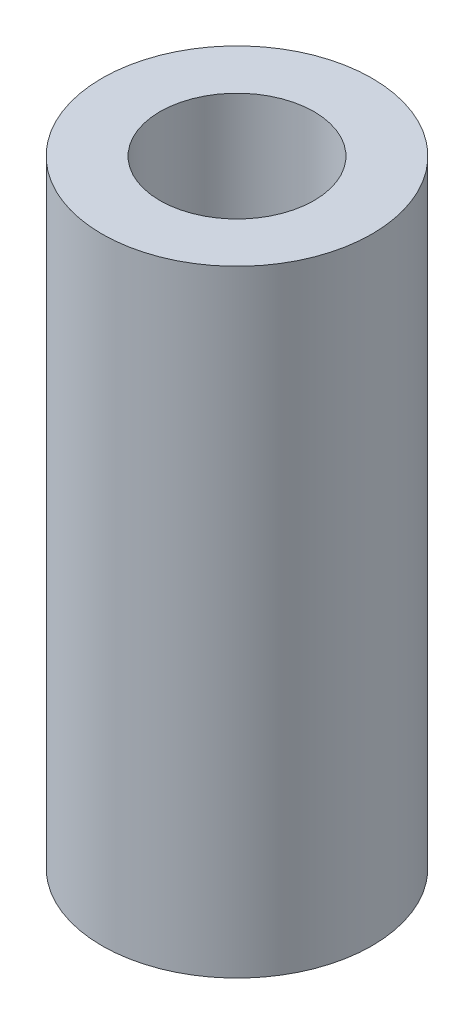
ISO-10303-21;
HEADER;
FILE_DESCRIPTION(('STEP AP214'),'2;1');
FILE_NAME('part.step','',(''),(''),'','','');
FILE_SCHEMA(('AUTOMOTIVE_DESIGN { 1 0 10303 214 1 1 1 1 }'));
ENDSEC;
DATA;
#1=APPLICATION_CONTEXT('core data for automotive mechanical design processes');
#2=APPLICATION_PROTOCOL_DEFINITION('international standard','automotive_design',2000,#1);
#3=PRODUCT_CONTEXT('',#1,'mechanical');
#4=PRODUCT('Part','Part','',(#3));
#5=PRODUCT_RELATED_PRODUCT_CATEGORY('part','',(#4));
#6=PRODUCT_DEFINITION_FORMATION('','',#4);
#7=PRODUCT_DEFINITION_CONTEXT('part definition',#1,'design');
#8=PRODUCT_DEFINITION('design','',#6,#7);
#9=PRODUCT_DEFINITION_SHAPE('','',#8);
#10=(LENGTH_UNIT() NAMED_UNIT(*) SI_UNIT(.MILLI.,.METRE.));
#11=(NAMED_UNIT(*) PLANE_ANGLE_UNIT() SI_UNIT($,.RADIAN.));
#12=(NAMED_UNIT(*) SI_UNIT($,.STERADIAN.) SOLID_ANGLE_UNIT());
#13=UNCERTAINTY_MEASURE_WITH_UNIT(LENGTH_MEASURE(1.E-05),#10,'distance_accuracy_value','');
#14=(GEOMETRIC_REPRESENTATION_CONTEXT(3) GLOBAL_UNCERTAINTY_ASSIGNED_CONTEXT((#13)) GLOBAL_UNIT_ASSIGNED_CONTEXT((#10,
#11,#12)) REPRESENTATION_CONTEXT('',''));
#15=CARTESIAN_POINT('',(0.,0.,0.));
#16=DIRECTION('',(0.,0.,1.));
#17=DIRECTION('',(1.,0.,0.));
#18=AXIS2_PLACEMENT_3D('',#15,#16,#17);
#19=CARTESIAN_POINT('',(0.,25.4,0.));
#20=DIRECTION('',(0.,1.,0.));
#21=DIRECTION('',(0.,0.,1.));
#22=AXIS2_PLACEMENT_3D('',#19,#20,#21);
#23=PLANE('',#22);
#24=CARTESIAN_POINT('',(0.,25.4,0.));
#25=DIRECTION('',(0.,1.,0.));
#26=DIRECTION('',(0.,0.,1.));
#27=AXIS2_PLACEMENT_3D('',#24,#25,#26);
#28=CIRCLE('',#27,5.5626);
#29=CARTESIAN_POINT('',(0.,25.4,5.5626));
#30=VERTEX_POINT('',#29);
#31=EDGE_CURVE('E10',#30,#30,#28,.T.);
#32=ORIENTED_EDGE('',*,*,#31,.T.);
#33=EDGE_LOOP('',(#32));
#34=FACE_BOUND('',#33,.T.);
#35=CARTESIAN_POINT('',(0.,25.4,0.));
#36=DIRECTION('',(0.,1.,0.));
#37=DIRECTION('',(0.,0.,1.));
#38=AXIS2_PLACEMENT_3D('',#35,#36,#37);
#39=CIRCLE('',#38,3.175);
#40=CARTESIAN_POINT('',(0.,25.4,3.175));
#41=VERTEX_POINT('',#40);
#42=EDGE_CURVE('E44',#41,#41,#39,.T.);
#43=ORIENTED_EDGE('',*,*,#42,.F.);
#44=EDGE_LOOP('',(#43));
#45=FACE_BOUND('',#44,.T.);
#46=ADVANCED_FACE('F33',(#34,#45),#23,.T.);
#47=CARTESIAN_POINT('',(0.,0.,0.));
#48=DIRECTION('',(0.,1.,0.));
#49=DIRECTION('',(0.,0.,1.));
#50=AXIS2_PLACEMENT_3D('',#47,#48,#49);
#51=PLANE('',#50);
#52=CARTESIAN_POINT('',(0.,0.,0.));
#53=DIRECTION('',(0.,1.,0.));
#54=DIRECTION('',(0.,0.,1.));
#55=AXIS2_PLACEMENT_3D('',#52,#53,#54);
#56=CIRCLE('',#55,5.5626);
#57=CARTESIAN_POINT('',(0.,0.,5.5626));
#58=VERTEX_POINT('',#57);
#59=EDGE_CURVE('E37',#58,#58,#56,.T.);
#60=ORIENTED_EDGE('',*,*,#59,.F.);
#61=EDGE_LOOP('',(#60));
#62=FACE_BOUND('',#61,.T.);
#63=CARTESIAN_POINT('',(0.,0.,0.));
#64=DIRECTION('',(0.,1.,0.));
#65=DIRECTION('',(0.,0.,1.));
#66=AXIS2_PLACEMENT_3D('',#63,#64,#65);
#67=CIRCLE('',#66,3.175);
#68=CARTESIAN_POINT('',(0.,0.,3.175));
#69=VERTEX_POINT('',#68);
#70=EDGE_CURVE('E46',#69,#69,#67,.T.);
#71=ORIENTED_EDGE('',*,*,#70,.T.);
#72=EDGE_LOOP('',(#71));
#73=FACE_BOUND('',#72,.T.);
#74=ADVANCED_FACE('F56',(#62,#73),#51,.F.);
#75=CARTESIAN_POINT('',(0.,25.4,0.));
#76=DIRECTION('',(0.,-1.,0.));
#77=DIRECTION('',(0.,0.,-1.));
#78=AXIS2_PLACEMENT_3D('',#75,#76,#77);
#79=CYLINDRICAL_SURFACE('',#78,5.5626);
#80=ORIENTED_EDGE('',*,*,#31,.F.);
#81=EDGE_LOOP('',(#80));
#82=FACE_BOUND('',#81,.T.);
#83=ORIENTED_EDGE('',*,*,#59,.T.);
#84=EDGE_LOOP('',(#83));
#85=FACE_BOUND('',#84,.T.);
#86=ADVANCED_FACE('F35',(#82,#85),#79,.T.);
#87=CARTESIAN_POINT('',(0.,25.4,0.));
#88=DIRECTION('',(0.,-1.,0.));
#89=DIRECTION('',(0.,0.,-1.));
#90=AXIS2_PLACEMENT_3D('',#87,#88,#89);
#91=CYLINDRICAL_SURFACE('',#90,3.175);
#92=ORIENTED_EDGE('',*,*,#42,.T.);
#93=EDGE_LOOP('',(#92));
#94=FACE_BOUND('',#93,.T.);
#95=ORIENTED_EDGE('',*,*,#70,.F.);
#96=EDGE_LOOP('',(#95));
#97=FACE_BOUND('',#96,.T.);
#98=ADVANCED_FACE('F52',(#94,#97),#91,.F.);
#99=CLOSED_SHELL('',(#46,#74,#86,#98));
#100=MANIFOLD_SOLID_BREP('B2',#99);
#101=ADVANCED_BREP_SHAPE_REPRESENTATION('',(#18,#100),#14);
#102=SHAPE_DEFINITION_REPRESENTATION(#9,#101);
ENDSEC;
END-ISO-10303-21;
